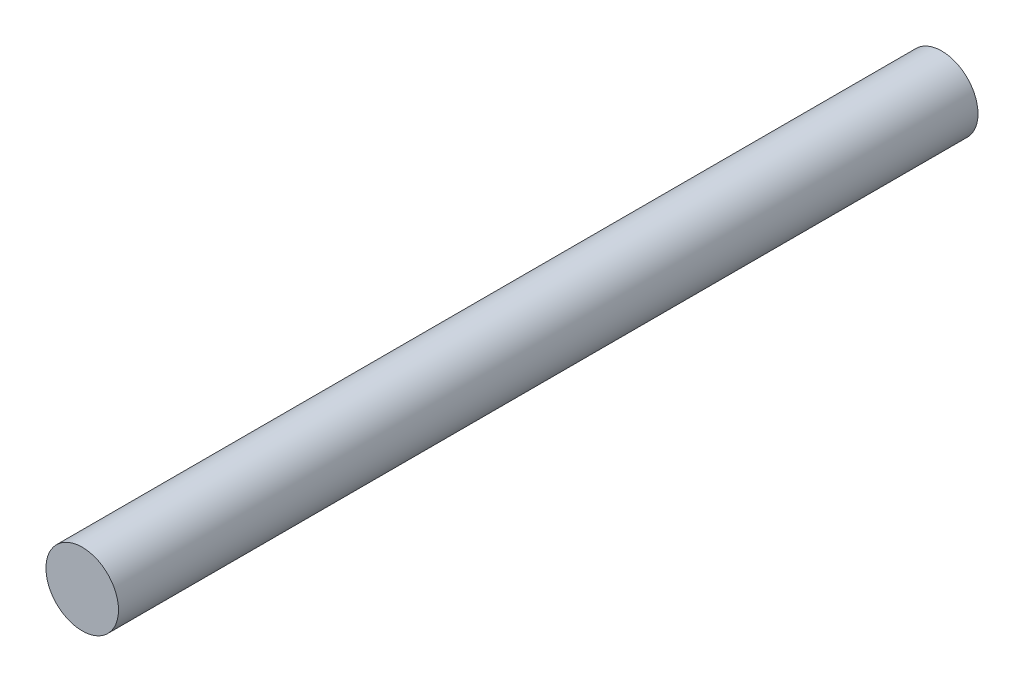
ISO-10303-21;
HEADER;
FILE_DESCRIPTION(('STEP AP214'),'2;1');
FILE_NAME('part.step','',(''),(''),'','','');
FILE_SCHEMA(('AUTOMOTIVE_DESIGN { 1 0 10303 214 1 1 1 1 }'));
ENDSEC;
DATA;
#1=APPLICATION_CONTEXT('core data for automotive mechanical design processes');
#2=APPLICATION_PROTOCOL_DEFINITION('international standard','automotive_design',2000,#1);
#3=PRODUCT_CONTEXT('',#1,'mechanical');
#4=PRODUCT('Part','Part','',(#3));
#5=PRODUCT_RELATED_PRODUCT_CATEGORY('part','',(#4));
#6=PRODUCT_DEFINITION_FORMATION('','',#4);
#7=PRODUCT_DEFINITION_CONTEXT('part definition',#1,'design');
#8=PRODUCT_DEFINITION('design','',#6,#7);
#9=PRODUCT_DEFINITION_SHAPE('','',#8);
#10=(LENGTH_UNIT() NAMED_UNIT(*) SI_UNIT(.MILLI.,.METRE.));
#11=(NAMED_UNIT(*) PLANE_ANGLE_UNIT() SI_UNIT($,.RADIAN.));
#12=(NAMED_UNIT(*) SI_UNIT($,.STERADIAN.) SOLID_ANGLE_UNIT());
#13=UNCERTAINTY_MEASURE_WITH_UNIT(LENGTH_MEASURE(1.E-05),#10,'distance_accuracy_value','');
#14=(GEOMETRIC_REPRESENTATION_CONTEXT(3) GLOBAL_UNCERTAINTY_ASSIGNED_CONTEXT((#13)) GLOBAL_UNIT_ASSIGNED_CONTEXT((#10,
#11,#12)) REPRESENTATION_CONTEXT('',''));
#15=CARTESIAN_POINT('',(0.,0.,0.));
#16=DIRECTION('',(0.,0.,1.));
#17=DIRECTION('',(1.,0.,0.));
#18=AXIS2_PLACEMENT_3D('',#15,#16,#17);
#19=CARTESIAN_POINT('',(0.,0.,90.));
#20=DIRECTION('',(0.,0.,-1.));
#21=DIRECTION('',(-1.,0.,0.));
#22=AXIS2_PLACEMENT_3D('',#19,#20,#21);
#23=CYLINDRICAL_SURFACE('',#22,3.8);
#24=CARTESIAN_POINT('',(0.,0.,90.));
#25=DIRECTION('',(0.,0.,1.));
#26=DIRECTION('',(1.,0.,0.));
#27=AXIS2_PLACEMENT_3D('',#24,#25,#26);
#28=CIRCLE('',#27,3.8);
#29=CARTESIAN_POINT('',(3.8,0.,90.));
#30=VERTEX_POINT('',#29);
#31=EDGE_CURVE('E10',#30,#30,#28,.T.);
#32=ORIENTED_EDGE('',*,*,#31,.F.);
#33=EDGE_LOOP('',(#32));
#34=FACE_BOUND('',#33,.T.);
#35=CARTESIAN_POINT('',(0.,0.,0.));
#36=DIRECTION('',(0.,0.,1.));
#37=DIRECTION('',(1.,0.,0.));
#38=AXIS2_PLACEMENT_3D('',#35,#36,#37);
#39=CIRCLE('',#38,3.8);
#40=CARTESIAN_POINT('',(3.8,0.,0.));
#41=VERTEX_POINT('',#40);
#42=EDGE_CURVE('E35',#41,#41,#39,.T.);
#43=ORIENTED_EDGE('',*,*,#42,.T.);
#44=EDGE_LOOP('',(#43));
#45=FACE_BOUND('',#44,.T.);
#46=ADVANCED_FACE('F32',(#34,#45),#23,.T.);
#47=CARTESIAN_POINT('',(0.,0.,90.));
#48=DIRECTION('',(0.,0.,1.));
#49=DIRECTION('',(1.,0.,0.));
#50=AXIS2_PLACEMENT_3D('',#47,#48,#49);
#51=PLANE('',#50);
#52=ORIENTED_EDGE('',*,*,#31,.T.);
#53=EDGE_LOOP('',(#52));
#54=FACE_BOUND('',#53,.T.);
#55=ADVANCED_FACE('F47',(#54),#51,.T.);
#56=CARTESIAN_POINT('',(0.,0.,0.));
#57=DIRECTION('',(0.,0.,1.));
#58=DIRECTION('',(1.,0.,0.));
#59=AXIS2_PLACEMENT_3D('',#56,#57,#58);
#60=PLANE('',#59);
#61=ORIENTED_EDGE('',*,*,#42,.F.);
#62=EDGE_LOOP('',(#61));
#63=FACE_BOUND('',#62,.T.);
#64=ADVANCED_FACE('F45',(#63),#60,.F.);
#65=CLOSED_SHELL('',(#46,#55,#64));
#66=MANIFOLD_SOLID_BREP('B2',#65);
#67=ADVANCED_BREP_SHAPE_REPRESENTATION('',(#18,#66),#14);
#68=SHAPE_DEFINITION_REPRESENTATION(#9,#67);
ENDSEC;
END-ISO-10303-21;
